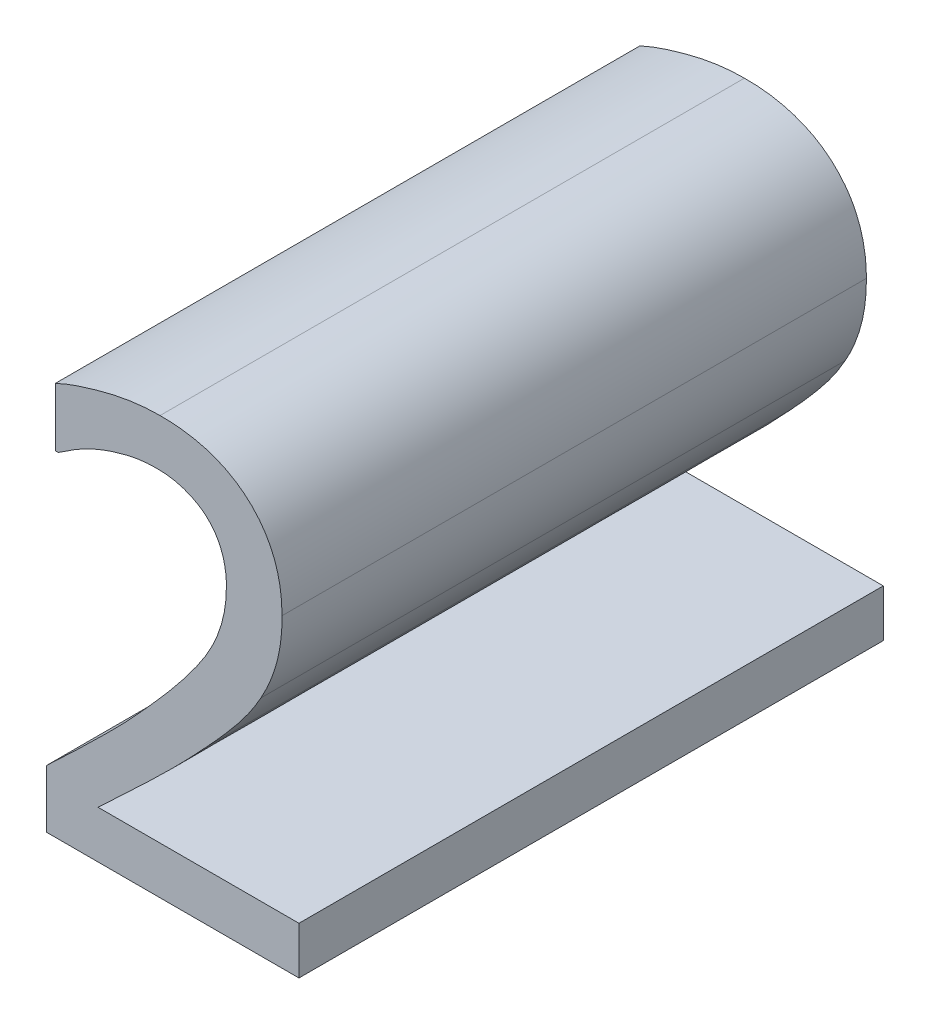
ISO-10303-21;
HEADER;
FILE_DESCRIPTION(('STEP AP214'),'2;1');
FILE_NAME('part.step','',(''),(''),'','','');
FILE_SCHEMA(('AUTOMOTIVE_DESIGN { 1 0 10303 214 1 1 1 1 }'));
ENDSEC;
DATA;
#1=APPLICATION_CONTEXT('core data for automotive mechanical design processes');
#2=APPLICATION_PROTOCOL_DEFINITION('international standard','automotive_design',2000,#1);
#3=PRODUCT_CONTEXT('',#1,'mechanical');
#4=PRODUCT('Part','Part','',(#3));
#5=PRODUCT_RELATED_PRODUCT_CATEGORY('part','',(#4));
#6=PRODUCT_DEFINITION_FORMATION('','',#4);
#7=PRODUCT_DEFINITION_CONTEXT('part definition',#1,'design');
#8=PRODUCT_DEFINITION('design','',#6,#7);
#9=PRODUCT_DEFINITION_SHAPE('','',#8);
#10=(LENGTH_UNIT() NAMED_UNIT(*) SI_UNIT(.MILLI.,.METRE.));
#11=(NAMED_UNIT(*) PLANE_ANGLE_UNIT() SI_UNIT($,.RADIAN.));
#12=(NAMED_UNIT(*) SI_UNIT($,.STERADIAN.) SOLID_ANGLE_UNIT());
#13=UNCERTAINTY_MEASURE_WITH_UNIT(LENGTH_MEASURE(1.E-05),#10,'distance_accuracy_value','');
#14=(GEOMETRIC_REPRESENTATION_CONTEXT(3) GLOBAL_UNCERTAINTY_ASSIGNED_CONTEXT((#13)) GLOBAL_UNIT_ASSIGNED_CONTEXT((#10,
#11,#12)) REPRESENTATION_CONTEXT('',''));
#15=CARTESIAN_POINT('',(0.,0.,0.));
#16=DIRECTION('',(0.,0.,1.));
#17=DIRECTION('',(1.,0.,0.));
#18=AXIS2_PLACEMENT_3D('',#15,#16,#17);
#19=CARTESIAN_POINT('',(0.573294689810317,-0.561987530902696,0.));
#20=DIRECTION('',(-1.,0.,0.));
#21=DIRECTION('',(0.,-1.,0.));
#22=AXIS2_PLACEMENT_3D('',#19,#20,#21);
#23=PLANE('',#22);
#24=DIRECTION('',(0.,1.,0.));
#25=VECTOR('',#24,1.);
#26=CARTESIAN_POINT('',(0.573294689810317,-0.571914597659679,0.));
#27=LINE('',#26,#25);
#28=CARTESIAN_POINT('',(0.573294689810317,-0.571914597659679,0.));
#29=VERTEX_POINT('',#28);
#30=CARTESIAN_POINT('',(0.573294689810317,-0.561987530902696,0.));
#31=VERTEX_POINT('',#30);
#32=EDGE_CURVE('E11',#29,#31,#27,.T.);
#33=ORIENTED_EDGE('',*,*,#32,.F.);
#34=DIRECTION('',(0.,0.,1.));
#35=VECTOR('',#34,1.);
#36=CARTESIAN_POINT('',(0.573294689810317,-0.571914597659679,0.));
#37=LINE('',#36,#35);
#38=CARTESIAN_POINT('',(0.573294689810317,-0.571914597659679,0.1));
#39=VERTEX_POINT('',#38);
#40=EDGE_CURVE('E351',#29,#39,#37,.T.);
#41=ORIENTED_EDGE('',*,*,#40,.T.);
#42=DIRECTION('',(0.,-1.,0.));
#43=VECTOR('',#42,1.);
#44=CARTESIAN_POINT('',(0.573294689810317,-0.561987530902696,0.1));
#45=LINE('',#44,#43);
#46=CARTESIAN_POINT('',(0.573294689810317,-0.561987530902696,0.1));
#47=VERTEX_POINT('',#46);
#48=EDGE_CURVE('E157',#47,#39,#45,.T.);
#49=ORIENTED_EDGE('',*,*,#48,.F.);
#50=DIRECTION('',(0.,0.,1.));
#51=VECTOR('',#50,1.);
#52=CARTESIAN_POINT('',(0.573294689810317,-0.561987530902696,0.));
#53=LINE('',#52,#51);
#54=EDGE_CURVE('E352',#31,#47,#53,.T.);
#55=ORIENTED_EDGE('',*,*,#54,.F.);
#56=EDGE_LOOP('',(#33,#41,#49,#55));
#57=FACE_BOUND('',#56,.T.);
#58=ADVANCED_FACE('F17',(#57),#23,.T.);
#59=CARTESIAN_POINT('',(0.590199066345065,-0.545139880463702,0.));
#60=CARTESIAN_POINT('',(0.590199066345065,-0.545139880463702,0.1));
#61=CARTESIAN_POINT('',(0.586228239642271,-0.549507789836774,0.));
#62=CARTESIAN_POINT('',(0.586228239642271,-0.549507789836774,0.1));
#63=CARTESIAN_POINT('',(0.57794622966216,-0.557619621529623,0.));
#64=CARTESIAN_POINT('',(0.57794622966216,-0.557619621529623,0.1));
#65=CARTESIAN_POINT('',(0.573294689810317,-0.561987530902696,0.));
#66=CARTESIAN_POINT('',(0.573294689810317,-0.561987530902696,0.1));
#67=B_SPLINE_SURFACE_WITH_KNOTS('',2,1,((#59,#60),(#61,#62),(#63,#64),(#65,#66)),.UNSPECIFIED.,
.F.,.F.,.F.,(3,1,3),(2,2),(0.,0.5,1.),(0.,1.),.UNSPECIFIED.);
#68=CARTESIAN_POINT('',(0.573294689810317,-0.561987530902696,0.));
#69=CARTESIAN_POINT('',(0.576216316409611,-0.55917190654432,0.));
#70=CARTESIAN_POINT('',(0.579188711820806,-0.556405094633854,0.));
#71=CARTESIAN_POINT('',(0.582501690728564,-0.553157419107484,0.));
#72=CARTESIAN_POINT('',(0.582914636400098,-0.552749607769018,0.));
#73=CARTESIAN_POINT('',(0.583765351493808,-0.55190173627245,0.));
#74=CARTESIAN_POINT('',(0.584202851229282,-0.551461404882065,0.));
#75=CARTESIAN_POINT('',(0.585512934330286,-0.550130571110377,0.));
#76=CARTESIAN_POINT('',(0.586379305432535,-0.5492339448571,0.));
#77=CARTESIAN_POINT('',(0.588235891459257,-0.547276807118519,0.));
#78=CARTESIAN_POINT('',(0.589223159247303,-0.546213498075349,0.));
#79=CARTESIAN_POINT('',(0.590199066381953,-0.545139880423125,0.));
#80=B_SPLINE_CURVE_WITH_KNOTS('',3,(#68,#69,#70,#71,#72,#73,#74,#75,#76,#77,#78,#79),
.UNSPECIFIED.,.F.,.F.,(4,2,2,2,2,4),(0.,0.0121766036694044,0.0139177205584069,
0.0157798614534184,0.0195200765979185,0.0238726498142932),.UNSPECIFIED.);
#81=CARTESIAN_POINT('',(0.590199066345065,-0.545139880463702,0.));
#82=VERTEX_POINT('',#81);
#83=EDGE_CURVE('E24',#31,#82,#80,.T.);
#84=CARTESIAN_POINT('',(0.590199066345065,-0.545139880463702,0.1));
#85=CARTESIAN_POINT('',(0.587611265979113,-0.548062208761191,0.1));
#86=CARTESIAN_POINT('',(0.584871099533745,-0.55083501950291,0.1));
#87=CARTESIAN_POINT('',(0.581670163810386,-0.553972509806504,0.1));
#88=CARTESIAN_POINT('',(0.581252112153177,-0.554380323541159,0.1));
#89=CARTESIAN_POINT('',(0.580379951566386,-0.555228549779289,0.1));
#90=CARTESIAN_POINT('',(0.579925735994419,-0.555668852074841,0.1));
#91=CARTESIAN_POINT('',(0.578539265538952,-0.557008142088938,0.1));
#92=CARTESIAN_POINT('',(0.577604548128001,-0.557904583348683,0.1));
#93=CARTESIAN_POINT('',(0.575546791079816,-0.559865325585856,0.1));
#94=CARTESIAN_POINT('',(0.574422515104232,-0.560928329933098,0.1));
#95=CARTESIAN_POINT('',(0.573294689810317,-0.561987530902696,0.1));
#96=B_SPLINE_CURVE_WITH_KNOTS('',3,(#84,#85,#86,#87,#88,#89,#90,#91,#92,#93,#94,#95),
.UNSPECIFIED.,.F.,.F.,(4,2,2,2,2,4),(0.,0.0116945562075137,0.0134466018522052,0.015344389911391,
0.0192296811545655,0.0238713644395515),.UNSPECIFIED.);
#97=CARTESIAN_POINT('',(0.590199066345065,-0.545139880463702,0.1));
#98=VERTEX_POINT('',#97);
#99=EDGE_CURVE('E361',#98,#47,#96,.T.);
#100=DIRECTION('',(0.,0.,1.));
#101=VECTOR('',#100,1.);
#102=CARTESIAN_POINT('',(0.590199066345065,-0.545139880463702,0.));
#103=LINE('',#102,#101);
#104=EDGE_CURVE('E365',#82,#98,#103,.T.);
#105=ORIENTED_EDGE('',*,*,#83,.F.);
#106=ORIENTED_EDGE('',*,*,#54,.T.);
#107=ORIENTED_EDGE('',*,*,#99,.F.);
#108=ORIENTED_EDGE('',*,*,#104,.F.);
#109=EDGE_LOOP('',(#105,#106,#107,#108));
#110=FACE_BOUND('',#109,.T.);
#111=ADVANCED_FACE('F266',(#110),#67,.T.);
#112=CARTESIAN_POINT('',(0.604040233709087,-0.520180398331859,0.));
#113=CARTESIAN_POINT('',(0.604040233709087,-0.520180398331859,0.1));
#114=CARTESIAN_POINT('',(0.604040233709087,-0.525796281811523,0.));
#115=CARTESIAN_POINT('',(0.604040233709087,-0.525796281811523,0.1));
#116=CARTESIAN_POINT('',(0.598197445846405,-0.536347335621803,0.));
#117=CARTESIAN_POINT('',(0.598197445846405,-0.536347335621803,0.1));
#118=CARTESIAN_POINT('',(0.590199066345065,-0.545139880463702,0.));
#119=CARTESIAN_POINT('',(0.590199066345065,-0.545139880463702,0.1));
#120=B_SPLINE_SURFACE_WITH_KNOTS('',2,1,((#112,#113),(#114,#115),(#116,#117),(#118,#119)),
.UNSPECIFIED.,.F.,.F.,.F.,(3,1,3),(2,2),(0.,0.5,1.),(0.,1.),.UNSPECIFIED.);
#121=CARTESIAN_POINT('',(0.590199066345065,-0.545139880463702,0.));
#122=CARTESIAN_POINT('',(0.591524711524654,-0.543676533635372,0.));
#123=CARTESIAN_POINT('',(0.592834662049742,-0.542200049203178,0.));
#124=CARTESIAN_POINT('',(0.595396665441898,-0.539173245774514,0.));
#125=CARTESIAN_POINT('',(0.596648024070647,-0.537622344445949,0.));
#126=CARTESIAN_POINT('',(0.599042447356157,-0.534421648737831,0.));
#127=CARTESIAN_POINT('',(0.600185167063988,-0.532771564840157,0.));
#128=CARTESIAN_POINT('',(0.601348278660586,-0.530654459686078,0.));
#129=CARTESIAN_POINT('',(0.601541016040058,-0.530284973397724,0.));
#130=CARTESIAN_POINT('',(0.601929997148157,-0.529491190910432,0.));
#131=CARTESIAN_POINT('',(0.602123802380378,-0.529065705361785,0.));
#132=CARTESIAN_POINT('',(0.602658496609068,-0.527793352123861,0.));
#133=CARTESIAN_POINT('',(0.602963669837758,-0.526931110910572,0.));
#134=CARTESIAN_POINT('',(0.603760028985515,-0.524151288703875,0.));
#135=CARTESIAN_POINT('',(0.60405290659742,-0.522175990312242,0.));
#136=CARTESIAN_POINT('',(0.604040233709087,-0.520180398314576,0.));
#137=B_SPLINE_CURVE_WITH_KNOTS('',3,(#121,#122,#123,#124,#125,#126,#127,#128,#129,#130,#131,
#132,#133,#134,#135,#136),.UNSPECIFIED.,.F.,.F.,(4,2,2,2,2,2,2,4),(0.,0.00592083735917927,
0.0118997721387449,0.0178970979462102,0.019146712576849,0.0205487103418681,0.023285997637654,
0.0292165184775067),.UNSPECIFIED.);
#138=CARTESIAN_POINT('',(0.604040233709087,-0.520180398331859,0.));
#139=VERTEX_POINT('',#138);
#140=EDGE_CURVE('E343',#82,#139,#137,.T.);
#141=CARTESIAN_POINT('',(0.604040233709087,-0.520180398331859,0.1));
#142=CARTESIAN_POINT('',(0.60406417221119,-0.522377012250735,0.1));
#143=CARTESIAN_POINT('',(0.603704080075652,-0.524540135297893,0.1));
#144=CARTESIAN_POINT('',(0.60254558091967,-0.528196073751297,0.1));
#145=CARTESIAN_POINT('',(0.601869775352023,-0.529727117086477,0.1));
#146=CARTESIAN_POINT('',(0.600765014282166,-0.531705845977494,0.1));
#147=CARTESIAN_POINT('',(0.600452349540385,-0.532223349459875,0.1));
#148=CARTESIAN_POINT('',(0.599708882732165,-0.533393617150779,0.1));
#149=CARTESIAN_POINT('',(0.599270341848248,-0.534041499295992,0.1));
#150=CARTESIAN_POINT('',(0.597746587168353,-0.536202450852496,0.1));
#151=CARTESIAN_POINT('',(0.596604757020398,-0.537674612300696,0.1));
#152=CARTESIAN_POINT('',(0.593735519304813,-0.541170982478962,0.1));
#153=CARTESIAN_POINT('',(0.591966488629269,-0.543162082060902,0.1));
#154=CARTESIAN_POINT('',(0.590199066345065,-0.545139880463702,0.1));
#155=B_SPLINE_CURVE_WITH_KNOTS('',3,(#141,#142,#143,#144,#145,#146,#147,#148,#149,#150,#151,
#152,#153,#154),.UNSPECIFIED.,.F.,.F.,(4,2,2,2,2,2,4),(0.,0.00650665118596637,
0.0114873313360519,0.0133008943452759,0.0156467614728971,0.0212325655414484,0.0292067960252894),.UNSPECIFIED.);
#156=CARTESIAN_POINT('',(0.604040233709087,-0.520180398331859,0.1));
#157=VERTEX_POINT('',#156);
#158=EDGE_CURVE('E364',#157,#98,#155,.T.);
#159=DIRECTION('',(0.,0.,1.));
#160=VECTOR('',#159,1.);
#161=CARTESIAN_POINT('',(0.604040233709087,-0.520180398331859,0.));
#162=LINE('',#161,#160);
#163=EDGE_CURVE('E367',#139,#157,#162,.T.);
#164=ORIENTED_EDGE('',*,*,#140,.F.);
#165=ORIENTED_EDGE('',*,*,#104,.T.);
#166=ORIENTED_EDGE('',*,*,#158,.F.);
#167=ORIENTED_EDGE('',*,*,#163,.F.);
#168=EDGE_LOOP('',(#164,#165,#166,#167));
#169=FACE_BOUND('',#168,.T.);
#170=ADVANCED_FACE('F261',(#169),#120,.T.);
#171=CARTESIAN_POINT('',(0.600579941868081,-0.51138785348996,0.));
#172=CARTESIAN_POINT('',(0.600579941868081,-0.51138785348996,0.1));
#173=CARTESIAN_POINT('',(0.602224998644952,-0.512806005883814,0.));
#174=CARTESIAN_POINT('',(0.602224998644952,-0.512806005883814,0.1));
#175=CARTESIAN_POINT('',(0.604040233709087,-0.517230641352641,0.));
#176=CARTESIAN_POINT('',(0.604040233709087,-0.517230641352641,0.1));
#177=CARTESIAN_POINT('',(0.604040233709087,-0.520180398331859,0.));
#178=CARTESIAN_POINT('',(0.604040233709087,-0.520180398331859,0.1));
#179=B_SPLINE_SURFACE_WITH_KNOTS('',2,1,((#171,#172),(#173,#174),(#175,#176),(#177,#178)),
.UNSPECIFIED.,.F.,.F.,.F.,(3,1,3),(2,2),(0.,0.5,1.),(0.,1.),.UNSPECIFIED.);
#180=CARTESIAN_POINT('',(0.604040233709087,-0.520180398331859,0.));
#181=CARTESIAN_POINT('',(0.604070231585503,-0.518822255746776,0.));
#182=CARTESIAN_POINT('',(0.603901593620076,-0.517419398683535,0.));
#183=CARTESIAN_POINT('',(0.603215857143765,-0.51511209191554,0.));
#184=CARTESIAN_POINT('',(0.602802293596008,-0.514173719082866,0.));
#185=CARTESIAN_POINT('',(0.601793792592667,-0.512606249680711,0.));
#186=CARTESIAN_POINT('',(0.601237649941505,-0.511951720961794,0.));
#187=CARTESIAN_POINT('',(0.600579938293071,-0.511387850408054,0.));
#188=B_SPLINE_CURVE_WITH_KNOTS('',3,(#180,#181,#182,#183,#184,#185,#186,#187),.UNSPECIFIED.,.F.,
.F.,(4,2,2,4),(0.,0.00412437798620111,0.00716191922484213,0.00972134548947158),.UNSPECIFIED.);
#189=CARTESIAN_POINT('',(0.600579941868081,-0.51138785348996,0.));
#190=VERTEX_POINT('',#189);
#191=EDGE_CURVE('E335',#139,#190,#188,.T.);
#192=CARTESIAN_POINT('',(0.600579941868081,-0.51138785348996,0.1));
#193=CARTESIAN_POINT('',(0.601266999594053,-0.511977197403441,0.1));
#194=CARTESIAN_POINT('',(0.601842906573219,-0.512664628218597,0.1));
#195=CARTESIAN_POINT('',(0.602839398169584,-0.514253729361758,0.1));
#196=CARTESIAN_POINT('',(0.60323627490595,-0.515170569578766,0.1));
#197=CARTESIAN_POINT('',(0.603903877512074,-0.517443144165378,0.1));
#198=CARTESIAN_POINT('',(0.604069072453246,-0.518833094703272,0.1));
#199=CARTESIAN_POINT('',(0.604040233709087,-0.520180398331859,0.1));
#200=B_SPLINE_CURVE_WITH_KNOTS('',3,(#192,#193,#194,#195,#196,#197,#198,#199),.UNSPECIFIED.,.F.,
.F.,(4,2,2,4),(0.,0.00267100911726211,0.00563254353652575,0.00972143011809526),.UNSPECIFIED.);
#201=CARTESIAN_POINT('',(0.600579941868081,-0.51138785348996,0.1));
#202=VERTEX_POINT('',#201);
#203=EDGE_CURVE('E382',#202,#157,#200,.T.);
#204=DIRECTION('',(0.,0.,1.));
#205=VECTOR('',#204,1.);
#206=CARTESIAN_POINT('',(0.600579941868081,-0.51138785348996,0.));
#207=LINE('',#206,#205);
#208=EDGE_CURVE('E380',#190,#202,#207,.T.);
#209=ORIENTED_EDGE('',*,*,#191,.F.);
#210=ORIENTED_EDGE('',*,*,#163,.T.);
#211=ORIENTED_EDGE('',*,*,#203,.F.);
#212=ORIENTED_EDGE('',*,*,#208,.F.);
#213=EDGE_LOOP('',(#209,#210,#211,#212));
#214=FACE_BOUND('',#213,.T.);
#215=ADVANCED_FACE('F390',(#214),#179,.T.);
#216=CARTESIAN_POINT('',(0.592014301409199,-0.50855154870225,0.));
#217=CARTESIAN_POINT('',(0.592014301409199,-0.50855154870225,0.1));
#218=CARTESIAN_POINT('',(0.594623701813891,-0.50855154870225,0.));
#219=CARTESIAN_POINT('',(0.594623701813891,-0.50855154870225,0.1));
#220=CARTESIAN_POINT('',(0.59893488509121,-0.509969701096105,0.));
#221=CARTESIAN_POINT('',(0.59893488509121,-0.509969701096105,0.1));
#222=CARTESIAN_POINT('',(0.600579941868081,-0.51138785348996,0.));
#223=CARTESIAN_POINT('',(0.600579941868081,-0.51138785348996,0.1));
#224=B_SPLINE_SURFACE_WITH_KNOTS('',2,1,((#216,#217),(#218,#219),(#220,#221),(#222,#223)),
.UNSPECIFIED.,.F.,.F.,.F.,(3,1,3),(2,2),(0.,0.5,1.),(0.,1.),.UNSPECIFIED.);
#225=CARTESIAN_POINT('',(0.600579941868081,-0.51138785348996,0.));
#226=CARTESIAN_POINT('',(0.599745664865478,-0.510654199528889,0.));
#227=CARTESIAN_POINT('',(0.598805019365823,-0.510081761562588,0.));
#228=CARTESIAN_POINT('',(0.59666949610508,-0.509161177782728,0.));
#229=CARTESIAN_POINT('',(0.595457477054397,-0.508851447241249,0.));
#230=CARTESIAN_POINT('',(0.593492142240787,-0.508592586748,0.));
#231=CARTESIAN_POINT('',(0.592749371104029,-0.508548750750198,0.));
#232=CARTESIAN_POINT('',(0.592014300690917,-0.50855154870225,0.));
#233=B_SPLINE_CURVE_WITH_KNOTS('',3,(#225,#226,#227,#228,#229,#230,#231,#232),.UNSPECIFIED.,.F.,
.F.,(4,2,2,4),(0.,0.00327718880556356,0.00697674411635673,0.00919573260062196),.UNSPECIFIED.);
#234=CARTESIAN_POINT('',(0.592014301409199,-0.50855154870225,0.));
#235=VERTEX_POINT('',#234);
#236=EDGE_CURVE('E327',#190,#235,#233,.T.);
#237=CARTESIAN_POINT('',(0.592014301409199,-0.50855154870225,0.1));
#238=CARTESIAN_POINT('',(0.593513450667551,-0.508522783684461,0.1));
#239=CARTESIAN_POINT('',(0.595058884503773,-0.508723611476949,0.1));
#240=CARTESIAN_POINT('',(0.597635103297595,-0.509525500051341,0.1));
#241=CARTESIAN_POINT('',(0.598701506595856,-0.510021467827318,0.1));
#242=CARTESIAN_POINT('',(0.599978587519254,-0.510895682706203,0.1));
#243=CARTESIAN_POINT('',(0.600286502698488,-0.511132663421018,0.1));
#244=CARTESIAN_POINT('',(0.600579941870766,-0.511387853492275,0.1));
#245=B_SPLINE_CURVE_WITH_KNOTS('',3,(#237,#238,#239,#240,#241,#242,#243,#244),.UNSPECIFIED.,.F.,
.F.,(4,2,2,4),(0.,0.00454745343299449,0.00802673764956294,0.00919087766314987),.UNSPECIFIED.);
#246=CARTESIAN_POINT('',(0.592014301409199,-0.50855154870225,0.1));
#247=VERTEX_POINT('',#246);
#248=EDGE_CURVE('E419',#247,#202,#245,.T.);
#249=DIRECTION('',(0.,0.,1.));
#250=VECTOR('',#249,1.);
#251=CARTESIAN_POINT('',(0.592014301409199,-0.50855154870225,0.));
#252=LINE('',#251,#250);
#253=EDGE_CURVE('E424',#235,#247,#252,.T.);
#254=ORIENTED_EDGE('',*,*,#236,.F.);
#255=ORIENTED_EDGE('',*,*,#208,.T.);
#256=ORIENTED_EDGE('',*,*,#248,.F.);
#257=ORIENTED_EDGE('',*,*,#253,.F.);
#258=EDGE_LOOP('',(#254,#255,#256,#257));
#259=FACE_BOUND('',#258,.T.);
#260=ADVANCED_FACE('F395',(#259),#224,.T.);
#261=CARTESIAN_POINT('',(0.582087234652216,-0.510763866436664,0.));
#262=CARTESIAN_POINT('',(0.582087234652216,-0.510763866436664,0.1));
#263=CARTESIAN_POINT('',(0.584413004578137,-0.509799522808842,0.));
#264=CARTESIAN_POINT('',(0.584413004578137,-0.509799522808842,0.1));
#265=CARTESIAN_POINT('',(0.589518353196014,-0.50855154870225,0.));
#266=CARTESIAN_POINT('',(0.589518353196014,-0.50855154870225,0.1));
#267=CARTESIAN_POINT('',(0.592014301409199,-0.50855154870225,0.));
#268=CARTESIAN_POINT('',(0.592014301409199,-0.50855154870225,0.1));
#269=B_SPLINE_SURFACE_WITH_KNOTS('',2,1,((#261,#262),(#263,#264),(#265,#266),(#267,#268)),
.UNSPECIFIED.,.F.,.F.,.F.,(3,1,3),(2,2),(0.,0.5,1.),(0.,1.),.UNSPECIFIED.);
#270=CARTESIAN_POINT('',(0.592014301409199,-0.50855154870225,0.));
#271=CARTESIAN_POINT('',(0.591158552900085,-0.508545347555565,0.));
#272=CARTESIAN_POINT('',(0.590305956338073,-0.508603696123068,0.));
#273=CARTESIAN_POINT('',(0.588621101074845,-0.508821493658442,0.));
#274=CARTESIAN_POINT('',(0.587788728125176,-0.508980022459483,0.));
#275=CARTESIAN_POINT('',(0.586136526910326,-0.509372498741971,0.));
#276=CARTESIAN_POINT('',(0.585316837424512,-0.509606996721446,0.));
#277=CARTESIAN_POINT('',(0.583690099434236,-0.510140324237424,0.));
#278=CARTESIAN_POINT('',(0.582883237582172,-0.510439727888596,0.));
#279=CARTESIAN_POINT('',(0.582087234652216,-0.510763866436664,0.));
#280=B_SPLINE_CURVE_WITH_KNOTS('',3,(#270,#271,#272,#273,#274,#275,#276,#277,#278,#279),
.UNSPECIFIED.,.F.,.F.,(4,2,2,2,4),(0.,0.00255970627533974,0.00509623645174986,
0.00765157447103018,0.0102305115459305),.UNSPECIFIED.);
#281=CARTESIAN_POINT('',(0.582087234652216,-0.510763866436664,0.));
#282=VERTEX_POINT('',#281);
#283=EDGE_CURVE('E317',#235,#282,#280,.T.);
#284=CARTESIAN_POINT('',(0.582087234652216,-0.510763866436664,0.1));
#285=CARTESIAN_POINT('',(0.582883237582168,-0.510439727888595,0.1));
#286=CARTESIAN_POINT('',(0.583690099434229,-0.510140324237425,0.1));
#287=CARTESIAN_POINT('',(0.585316837424507,-0.509606996721449,0.1));
#288=CARTESIAN_POINT('',(0.586136526910324,-0.509372498741975,0.1));
#289=CARTESIAN_POINT('',(0.587788728124342,-0.508980022459678,0.1));
#290=CARTESIAN_POINT('',(0.588621101073155,-0.508821493658753,0.1));
#291=CARTESIAN_POINT('',(0.590305956334638,-0.508603696123401,0.1));
#292=CARTESIAN_POINT('',(0.591158552895759,-0.5085453475558,0.1));
#293=CARTESIAN_POINT('',(0.592014301403989,-0.50855154870225,0.1));
#294=B_SPLINE_CURVE_WITH_KNOTS('',3,(#284,#285,#286,#287,#288,#289,#290,#291,#292,#293),
.UNSPECIFIED.,.F.,.F.,(4,2,2,2,4),(0.,0.00257893707489087,0.00513427509418064,
0.00767080526802346,0.0102305115407303),.UNSPECIFIED.);
#295=CARTESIAN_POINT('',(0.582087234652216,-0.510763866436664,0.1));
#296=VERTEX_POINT('',#295);
#297=EDGE_CURVE('E422',#296,#247,#294,.T.);
#298=DIRECTION('',(0.,0.,1.));
#299=VECTOR('',#298,1.);
#300=CARTESIAN_POINT('',(0.582087234652216,-0.510763866436664,0.));
#301=LINE('',#300,#299);
#302=EDGE_CURVE('E428',#282,#296,#301,.T.);
#303=ORIENTED_EDGE('',*,*,#283,.F.);
#304=ORIENTED_EDGE('',*,*,#253,.T.);
#305=ORIENTED_EDGE('',*,*,#297,.F.);
#306=ORIENTED_EDGE('',*,*,#302,.F.);
#307=EDGE_LOOP('',(#303,#304,#305,#306));
#308=FACE_BOUND('',#307,.T.);
#309=ADVANCED_FACE('F439',(#308),#269,.T.);
#310=CARTESIAN_POINT('',(0.575280103161713,-0.514621240947948,0.));
#311=CARTESIAN_POINT('',(0.575280103161713,-0.514621240947948,0.1));
#312=CARTESIAN_POINT('',(0.576414625076797,-0.51382707560739,0.));
#313=CARTESIAN_POINT('',(0.576414625076797,-0.51382707560739,0.1));
#314=CARTESIAN_POINT('',(0.580101821300819,-0.511558031777222,0.));
#315=CARTESIAN_POINT('',(0.580101821300819,-0.511558031777222,0.1));
#316=CARTESIAN_POINT('',(0.582087234652216,-0.510763866436664,0.));
#317=CARTESIAN_POINT('',(0.582087234652216,-0.510763866436664,0.1));
#318=B_SPLINE_SURFACE_WITH_KNOTS('',2,1,((#310,#311),(#312,#313),(#314,#315),(#316,#317)),
.UNSPECIFIED.,.F.,.F.,.F.,(3,1,3),(2,2),(0.,0.5,1.),(0.,1.),.UNSPECIFIED.);
#319=CARTESIAN_POINT('',(0.582087234652216,-0.510763866436664,0.));
#320=CARTESIAN_POINT('',(0.580732992394999,-0.51126516772344,0.));
#321=CARTESIAN_POINT('',(0.579478720933333,-0.511949656539129,0.));
#322=CARTESIAN_POINT('',(0.577897546980419,-0.512912091442426,0.));
#323=CARTESIAN_POINT('',(0.577539820250363,-0.513136729939855,0.));
#324=CARTESIAN_POINT('',(0.576859655881338,-0.513568921794931,0.));
#325=CARTESIAN_POINT('',(0.576537000324371,-0.513776144946892,0.));
#326=CARTESIAN_POINT('',(0.575901788077059,-0.514194264618407,0.));
#327=CARTESIAN_POINT('',(0.575589152712453,-0.514405042135403,0.));
#328=CARTESIAN_POINT('',(0.57528010316312,-0.514621240946963,0.));
#329=B_SPLINE_CURVE_WITH_KNOTS('',3,(#319,#320,#321,#322,#323,#324,#325,#326,#327,#328),
.UNSPECIFIED.,.F.,.F.,(4,2,2,2,4),(0.,0.00428732594090233,0.00555429775329131,
0.00670467168244862,0.00783584904493355),.UNSPECIFIED.);
#330=CARTESIAN_POINT('',(0.575280103161713,-0.514621240947948,0.));
#331=VERTEX_POINT('',#330);
#332=EDGE_CURVE('E307',#282,#331,#329,.T.);
#333=CARTESIAN_POINT('',(0.575280103161713,-0.514621240947948,0.1));
#334=CARTESIAN_POINT('',(0.575752210850818,-0.514298398797895,0.1));
#335=CARTESIAN_POINT('',(0.576227396459358,-0.513979887178841,0.1));
#336=CARTESIAN_POINT('',(0.577230755029632,-0.513326593784717,0.1));
#337=CARTESIAN_POINT('',(0.57775973943285,-0.512993061577079,0.1));
#338=CARTESIAN_POINT('',(0.578664360267754,-0.512447007068512,0.1));
#339=CARTESIAN_POINT('',(0.579036648798705,-0.512229048891497,0.1));
#340=CARTESIAN_POINT('',(0.579816123471838,-0.511802064786014,0.1));
#341=CARTESIAN_POINT('',(0.580224054875496,-0.511594388663626,0.1));
#342=CARTESIAN_POINT('',(0.581114082661705,-0.511171871837105,0.1));
#343=CARTESIAN_POINT('',(0.581597976689262,-0.510960796810176,0.1));
#344=CARTESIAN_POINT('',(0.582087234652216,-0.510763866436664,0.1));
#345=B_SPLINE_CURVE_WITH_KNOTS('',3,(#333,#334,#335,#336,#337,#338,#339,#340,#341,#342,#343,
#344),.UNSPECIFIED.,.F.,.F.,(4,2,2,2,2,4),(0.,0.00171592048433093,0.00359173599418033,
0.00488550807886556,0.00625797846467483,0.00784044577355749),.UNSPECIFIED.);
#346=CARTESIAN_POINT('',(0.575280103161713,-0.514621240947948,0.1));
#347=VERTEX_POINT('',#346);
#348=EDGE_CURVE('E474',#347,#296,#345,.T.);
#349=DIRECTION('',(0.,0.,1.));
#350=VECTOR('',#349,1.);
#351=CARTESIAN_POINT('',(0.575280103161713,-0.514621240947948,0.));
#352=LINE('',#351,#350);
#353=EDGE_CURVE('E479',#331,#347,#352,.T.);
#354=ORIENTED_EDGE('',*,*,#332,.F.);
#355=ORIENTED_EDGE('',*,*,#302,.T.);
#356=ORIENTED_EDGE('',*,*,#348,.F.);
#357=ORIENTED_EDGE('',*,*,#353,.F.);
#358=EDGE_LOOP('',(#354,#355,#356,#357));
#359=FACE_BOUND('',#358,.T.);
#360=ADVANCED_FACE('F450',(#359),#318,.T.);
#361=CARTESIAN_POINT('',(0.574769568299925,-0.514621240947948,0.));
#362=DIRECTION('',(0.,-1.,0.));
#363=DIRECTION('',(1.,0.,0.));
#364=AXIS2_PLACEMENT_3D('',#361,#362,#363);
#365=PLANE('',#364);
#366=DIRECTION('',(-1.,0.,0.));
#367=VECTOR('',#366,1.);
#368=CARTESIAN_POINT('',(0.575280103161713,-0.514621240947948,0.));
#369=LINE('',#368,#367);
#370=CARTESIAN_POINT('',(0.574769568299925,-0.514621240947948,0.));
#371=VERTEX_POINT('',#370);
#372=EDGE_CURVE('E425',#331,#371,#369,.T.);
#373=ORIENTED_EDGE('',*,*,#372,.F.);
#374=ORIENTED_EDGE('',*,*,#353,.T.);
#375=DIRECTION('',(1.,0.,0.));
#376=VECTOR('',#375,1.);
#377=CARTESIAN_POINT('',(0.574769568299925,-0.514621240947948,0.1));
#378=LINE('',#377,#376);
#379=CARTESIAN_POINT('',(0.574769568299925,-0.514621240947948,0.1));
#380=VERTEX_POINT('',#379);
#381=EDGE_CURVE('E478',#380,#347,#378,.T.);
#382=ORIENTED_EDGE('',*,*,#381,.F.);
#383=DIRECTION('',(0.,0.,1.));
#384=VECTOR('',#383,1.);
#385=CARTESIAN_POINT('',(0.574769568299925,-0.514621240947948,0.));
#386=LINE('',#385,#384);
#387=EDGE_CURVE('E481',#371,#380,#386,.T.);
#388=ORIENTED_EDGE('',*,*,#387,.F.);
#389=EDGE_LOOP('',(#373,#374,#382,#388));
#390=FACE_BOUND('',#389,.T.);
#391=ADVANCED_FACE('F500',(#390),#365,.T.);
#392=CARTESIAN_POINT('',(0.574769568299925,-0.504637448095211,0.));
#393=DIRECTION('',(-1.,0.,0.));
#394=DIRECTION('',(0.,-1.,0.));
#395=AXIS2_PLACEMENT_3D('',#392,#393,#394);
#396=PLANE('',#395);
#397=DIRECTION('',(0.,1.,0.));
#398=VECTOR('',#397,1.);
#399=CARTESIAN_POINT('',(0.574769568299925,-0.514621240947948,0.));
#400=LINE('',#399,#398);
#401=CARTESIAN_POINT('',(0.574769568299925,-0.504637448095211,0.));
#402=VERTEX_POINT('',#401);
#403=EDGE_CURVE('E468',#371,#402,#400,.T.);
#404=ORIENTED_EDGE('',*,*,#403,.F.);
#405=ORIENTED_EDGE('',*,*,#387,.T.);
#406=DIRECTION('',(0.,-1.,0.));
#407=VECTOR('',#406,1.);
#408=CARTESIAN_POINT('',(0.574769568299925,-0.504637448095211,0.1));
#409=LINE('',#408,#407);
#410=CARTESIAN_POINT('',(0.574769568299925,-0.504637448095211,0.1));
#411=VERTEX_POINT('',#410);
#412=EDGE_CURVE('E252',#411,#380,#409,.T.);
#413=ORIENTED_EDGE('',*,*,#412,.F.);
#414=DIRECTION('',(0.,0.,1.));
#415=VECTOR('',#414,1.);
#416=CARTESIAN_POINT('',(0.574769568299925,-0.504637448095211,0.));
#417=LINE('',#416,#415);
#418=EDGE_CURVE('E491',#402,#411,#417,.T.);
#419=ORIENTED_EDGE('',*,*,#418,.F.);
#420=EDGE_LOOP('',(#404,#405,#413,#419));
#421=FACE_BOUND('',#420,.T.);
#422=ADVANCED_FACE('F498',(#421),#396,.T.);
#423=CARTESIAN_POINT('',(0.592695014558249,-0.500439717009401,0.));
#424=CARTESIAN_POINT('',(0.592695014558249,-0.500439717009401,0.1));
#425=CARTESIAN_POINT('',(0.588043474706406,-0.500439717009401,0.));
#426=CARTESIAN_POINT('',(0.588043474706406,-0.500439717009401,0.1));
#427=CARTESIAN_POINT('',(0.577662599183389,-0.503219295701357,0.));
#428=CARTESIAN_POINT('',(0.577662599183389,-0.503219295701357,0.1));
#429=CARTESIAN_POINT('',(0.574769568299925,-0.504637448095211,0.));
#430=CARTESIAN_POINT('',(0.574769568299925,-0.504637448095211,0.1));
#431=B_SPLINE_SURFACE_WITH_KNOTS('',2,1,((#423,#424),(#425,#426),(#427,#428),(#429,#430)),
.UNSPECIFIED.,.F.,.F.,.F.,(3,1,3),(2,2),(0.,0.5,1.),(0.,1.),.UNSPECIFIED.);
#432=CARTESIAN_POINT('',(0.574769568299925,-0.504637448095211,0.));
#433=CARTESIAN_POINT('',(0.575723895001914,-0.504185517917475,0.));
#434=CARTESIAN_POINT('',(0.576698725124831,-0.503784265499204,0.));
#435=CARTESIAN_POINT('',(0.579311184294512,-0.50282506422585,0.));
#436=CARTESIAN_POINT('',(0.580972857545884,-0.502331704906202,0.));
#437=CARTESIAN_POINT('',(0.583227350031078,-0.501730063709279,0.));
#438=CARTESIAN_POINT('',(0.583811107151062,-0.501580339463478,0.));
#439=CARTESIAN_POINT('',(0.584935981868762,-0.501318735083703,0.));
#440=CARTESIAN_POINT('',(0.58547659089829,-0.501204739146458,0.));
#441=CARTESIAN_POINT('',(0.587065690362383,-0.500902151894957,0.));
#442=CARTESIAN_POINT('',(0.588119941718635,-0.500742504555591,0.));
#443=CARTESIAN_POINT('',(0.590346438551188,-0.500505960659923,0.));
#444=CARTESIAN_POINT('',(0.591519737538325,-0.500439181621366,0.));
#445=CARTESIAN_POINT('',(0.592695014558249,-0.500439717009401,0.));
#446=B_SPLINE_CURVE_WITH_KNOTS('',3,(#432,#433,#434,#435,#436,#437,#438,#439,#440,#441,#442,
#443,#444,#445),.UNSPECIFIED.,.F.,.F.,(4,2,2,2,2,2,4),(0.,0.0031615158714135,
0.00835102058707288,0.010158997140672,0.0118160449842019,0.0150107970263109,0.0185318560347153),.UNSPECIFIED.);
#447=CARTESIAN_POINT('',(0.592695014558249,-0.500439717009401,0.));
#448=VERTEX_POINT('',#447);
#449=EDGE_CURVE('E298',#402,#448,#446,.T.);
#450=CARTESIAN_POINT('',(0.592695014558249,-0.500439717009401,0.1));
#451=CARTESIAN_POINT('',(0.59112185370362,-0.500440300590919,0.1));
#452=CARTESIAN_POINT('',(0.589553500476814,-0.500558958649346,0.1));
#453=CARTESIAN_POINT('',(0.586453335429828,-0.50098887760499,0.1));
#454=CARTESIAN_POINT('',(0.584921348924231,-0.501298839461806,0.1));
#455=CARTESIAN_POINT('',(0.582984699393494,-0.501792359836876,0.1));
#456=CARTESIAN_POINT('',(0.582560750867552,-0.501906777133215,0.1));
#457=CARTESIAN_POINT('',(0.581373829808555,-0.502236213615014,0.1));
#458=CARTESIAN_POINT('',(0.580612733348325,-0.502458057168336,0.1));
#459=CARTESIAN_POINT('',(0.578970883055163,-0.50296958639819,0.1));
#460=CARTESIAN_POINT('',(0.578091634892583,-0.503264401833177,0.1));
#461=CARTESIAN_POINT('',(0.576392874753508,-0.503906298922946,0.1));
#462=CARTESIAN_POINT('',(0.57557237999202,-0.504250819188127,0.1));
#463=CARTESIAN_POINT('',(0.574769568299925,-0.504637448095211,0.1));
#464=B_SPLINE_CURVE_WITH_KNOTS('',3,(#450,#451,#452,#453,#454,#455,#456,#457,#458,#459,#460,
#461,#462,#463),.UNSPECIFIED.,.F.,.F.,(4,2,2,2,2,2,4),(0.,0.00470874644985155,
0.00938586489214671,0.0107032565631256,0.0130813829969706,0.0158612414537463,
0.0185299408991349),.UNSPECIFIED.);
#465=CARTESIAN_POINT('',(0.592695014558249,-0.500439717009401,0.1));
#466=VERTEX_POINT('',#465);
#467=EDGE_CURVE('E497',#466,#411,#464,.T.);
#468=DIRECTION('',(0.,0.,1.));
#469=VECTOR('',#468,1.);
#470=CARTESIAN_POINT('',(0.592695014558249,-0.500439717009401,0.));
#471=LINE('',#470,#469);
#472=EDGE_CURVE('E253',#448,#466,#471,.T.);
#473=ORIENTED_EDGE('',*,*,#449,.F.);
#474=ORIENTED_EDGE('',*,*,#418,.T.);
#475=ORIENTED_EDGE('',*,*,#467,.F.);
#476=ORIENTED_EDGE('',*,*,#472,.F.);
#477=EDGE_LOOP('',(#473,#474,#475,#476));
#478=FACE_BOUND('',#477,.T.);
#479=ADVANCED_FACE('F506',(#478),#431,.T.);
#480=CARTESIAN_POINT('',(0.61357021779579,-0.519669863470071,0.));
#481=CARTESIAN_POINT('',(0.61357021779579,-0.519669863470071,0.1));
#482=CARTESIAN_POINT('',(0.61357021779579,-0.510820592532418,0.));
#483=CARTESIAN_POINT('',(0.61357021779579,-0.510820592532418,0.1));
#484=CARTESIAN_POINT('',(0.602508629123723,-0.500439717009401,0.));
#485=CARTESIAN_POINT('',(0.602508629123723,-0.500439717009401,0.1));
#486=CARTESIAN_POINT('',(0.592695014558249,-0.500439717009401,0.));
#487=CARTESIAN_POINT('',(0.592695014558249,-0.500439717009401,0.1));
#488=B_SPLINE_SURFACE_WITH_KNOTS('',2,1,((#480,#481),(#482,#483),(#484,#485),(#486,#487)),
.UNSPECIFIED.,.F.,.F.,.F.,(3,1,3),(2,2),(0.,0.5,1.),(0.,1.),.UNSPECIFIED.);
#489=CARTESIAN_POINT('',(0.592695014558249,-0.500439717009401,0.));
#490=CARTESIAN_POINT('',(0.595318287264719,-0.500397798399018,0.));
#491=CARTESIAN_POINT('',(0.598045817535943,-0.500710064715241,0.));
#492=CARTESIAN_POINT('',(0.602519867466159,-0.502046464478418,0.));
#493=CARTESIAN_POINT('',(0.604336023532649,-0.502862342056252,0.));
#494=CARTESIAN_POINT('',(0.607412537582716,-0.504949302088161,0.));
#495=CARTESIAN_POINT('',(0.608712427785279,-0.506158888549942,0.));
#496=CARTESIAN_POINT('',(0.610843079733854,-0.508887088800989,0.));
#497=CARTESIAN_POINT('',(0.611684482227135,-0.510397471276909,0.));
#498=CARTESIAN_POINT('',(0.612945641999857,-0.513738767027488,0.));
#499=CARTESIAN_POINT('',(0.613319058260568,-0.515586416039221,0.));
#500=CARTESIAN_POINT('',(0.613541382772436,-0.518186902531669,0.));
#501=CARTESIAN_POINT('',(0.613570637175046,-0.518930421007781,0.));
#502=CARTESIAN_POINT('',(0.61357021779579,-0.519669865484994,0.));
#503=B_SPLINE_CURVE_WITH_KNOTS('',3,(#489,#490,#491,#492,#493,#494,#495,#496,#497,#498,#499,
#500,#501,#502),.UNSPECIFIED.,.F.,.F.,(4,2,2,2,2,2,4),(0.,0.00799345192914853,
0.0138897760095676,0.019123137565657,0.0242292188772302,0.0298088468736183,0.0320354749233682),.UNSPECIFIED.);
#504=CARTESIAN_POINT('',(0.61357021779579,-0.519669863470071,0.));
#505=VERTEX_POINT('',#504);
#506=EDGE_CURVE('E290',#448,#505,#503,.T.);
#507=CARTESIAN_POINT('',(0.61357021779579,-0.519669863470071,0.1));
#508=CARTESIAN_POINT('',(0.613568968735143,-0.518552865609963,0.1));
#509=CARTESIAN_POINT('',(0.613503266297554,-0.517431203471963,0.1));
#510=CARTESIAN_POINT('',(0.613205939788636,-0.515204797186256,0.1));
#511=CARTESIAN_POINT('',(0.612973401510637,-0.51410018066033,0.1));
#512=CARTESIAN_POINT('',(0.612110880618919,-0.511323566517546,0.1));
#513=CARTESIAN_POINT('',(0.611328698049318,-0.509693568393347,0.1));
#514=CARTESIAN_POINT('',(0.609320035705978,-0.506824059542324,0.1));
#515=CARTESIAN_POINT('',(0.608110488665896,-0.505572645080523,0.1));
#516=CARTESIAN_POINT('',(0.605318441762312,-0.503443216951415,0.1));
#517=CARTESIAN_POINT('',(0.603722180121419,-0.502583504159674,0.1));
#518=CARTESIAN_POINT('',(0.600096367679544,-0.50122110480616,0.1));
#519=CARTESIAN_POINT('',(0.598038606868748,-0.50079949212939,0.1));
#520=CARTESIAN_POINT('',(0.594874609604048,-0.500487963774508,0.1));
#521=CARTESIAN_POINT('',(0.593780495473793,-0.500440642706806,0.1));
#522=CARTESIAN_POINT('',(0.592695011825789,-0.500439717009401,0.1));
#523=B_SPLINE_CURVE_WITH_KNOTS('',3,(#507,#508,#509,#510,#511,#512,#513,#514,#515,#516,#517,
#518,#519,#520,#521,#522),.UNSPECIFIED.,.F.,.F.,(4,2,2,2,2,2,2,4),(0.,0.00335570588104571,
0.00672994178384968,0.0120588098669923,0.0171966444164699,0.0225546661887966,0.0287863557245979,
0.0320591477113257),.UNSPECIFIED.);
#524=CARTESIAN_POINT('',(0.61357021779579,-0.519669863470071,0.1));
#525=VERTEX_POINT('',#524);
#526=EDGE_CURVE('E525',#525,#466,#523,.T.);
#527=DIRECTION('',(0.,0.,1.));
#528=VECTOR('',#527,1.);
#529=CARTESIAN_POINT('',(0.61357021779579,-0.519669863470071,0.));
#530=LINE('',#529,#528);
#531=EDGE_CURVE('E523',#505,#525,#530,.T.);
#532=ORIENTED_EDGE('',*,*,#506,.F.);
#533=ORIENTED_EDGE('',*,*,#472,.T.);
#534=ORIENTED_EDGE('',*,*,#526,.F.);
#535=ORIENTED_EDGE('',*,*,#531,.F.);
#536=EDGE_LOOP('',(#532,#533,#534,#535));
#537=FACE_BOUND('',#536,.T.);
#538=ADVANCED_FACE('F230',(#537),#488,.T.);
#539=CARTESIAN_POINT('',(0.609939747667522,-0.533681209121356,0.));
#540=CARTESIAN_POINT('',(0.609939747667522,-0.533681209121356,0.1));
#541=CARTESIAN_POINT('',(0.611641530540148,-0.530731452142138,0.));
#542=CARTESIAN_POINT('',(0.611641530540148,-0.530731452142138,0.1));
#543=CARTESIAN_POINT('',(0.61357021779579,-0.523810868460127,0.));
#544=CARTESIAN_POINT('',(0.61357021779579,-0.523810868460127,0.1));
#545=CARTESIAN_POINT('',(0.61357021779579,-0.519669863470071,0.));
#546=CARTESIAN_POINT('',(0.61357021779579,-0.519669863470071,0.1));
#547=B_SPLINE_SURFACE_WITH_KNOTS('',2,1,((#539,#540),(#541,#542),(#543,#544),(#545,#546)),
.UNSPECIFIED.,.F.,.F.,.F.,(3,1,3),(2,2),(0.,0.5,1.),(0.,1.),.UNSPECIFIED.);
#548=CARTESIAN_POINT('',(0.61357021779579,-0.519669863470071,0.));
#549=CARTESIAN_POINT('',(0.613594723295556,-0.522295725723965,0.));
#550=CARTESIAN_POINT('',(0.613273275419616,-0.524829491334319,0.));
#551=CARTESIAN_POINT('',(0.612001171344973,-0.529483448805852,0.));
#552=CARTESIAN_POINT('',(0.611112462511491,-0.531620131745927,0.));
#553=CARTESIAN_POINT('',(0.609939747667522,-0.533681209121356,0.));
#554=B_SPLINE_CURVE_WITH_KNOTS('',3,(#548,#549,#550,#551,#552,#553),.UNSPECIFIED.,.F.,.F.,(4,2,
4),(0.,0.00766222370767338,0.014604626490142),.UNSPECIFIED.);
#555=CARTESIAN_POINT('',(0.609939747667522,-0.533681209121356,0.));
#556=VERTEX_POINT('',#555);
#557=EDGE_CURVE('E243',#505,#556,#554,.T.);
#558=CARTESIAN_POINT('',(0.609939747667522,-0.533681209121356,0.1));
#559=CARTESIAN_POINT('',(0.611112462506812,-0.53162013173613,0.1));
#560=CARTESIAN_POINT('',(0.612001171340295,-0.529483448796055,0.1));
#561=CARTESIAN_POINT('',(0.613273275720624,-0.524829490262795,0.1));
#562=CARTESIAN_POINT('',(0.613594723596564,-0.522295723511202,0.1));
#563=CARTESIAN_POINT('',(0.61357021779579,-0.519669860046354,0.1));
#564=B_SPLINE_CURVE_WITH_KNOTS('',3,(#558,#559,#560,#561,#562,#563),.UNSPECIFIED.,.F.,.F.,(4,2,
4),(0.,0.00694240278246863,0.0146046298866351),.UNSPECIFIED.);
#565=CARTESIAN_POINT('',(0.609939747667522,-0.533681209121356,0.1));
#566=VERTEX_POINT('',#565);
#567=EDGE_CURVE('E216',#566,#525,#564,.T.);
#568=DIRECTION('',(0.,0.,1.));
#569=VECTOR('',#568,1.);
#570=CARTESIAN_POINT('',(0.609939747667522,-0.533681209121356,0.));
#571=LINE('',#570,#569);
#572=EDGE_CURVE('E223',#556,#566,#571,.T.);
#573=ORIENTED_EDGE('',*,*,#557,.F.);
#574=ORIENTED_EDGE('',*,*,#531,.T.);
#575=ORIENTED_EDGE('',*,*,#567,.F.);
#576=ORIENTED_EDGE('',*,*,#572,.F.);
#577=EDGE_LOOP('',(#573,#574,#575,#576));
#578=FACE_BOUND('',#577,.T.);
#579=ADVANCED_FACE('F224',(#578),#547,.T.);
#580=CARTESIAN_POINT('',(0.600579941868081,-0.545650415325489,0.));
#581=CARTESIAN_POINT('',(0.600579941868081,-0.545650415325489,0.1));
#582=CARTESIAN_POINT('',(0.603302794464282,-0.542757384442026,0.));
#583=CARTESIAN_POINT('',(0.603302794464282,-0.542757384442026,0.1));
#584=CARTESIAN_POINT('',(0.608237964794896,-0.536744418292082,0.));
#585=CARTESIAN_POINT('',(0.608237964794896,-0.536744418292082,0.1));
#586=CARTESIAN_POINT('',(0.609939747667522,-0.533681209121356,0.));
#587=CARTESIAN_POINT('',(0.609939747667522,-0.533681209121356,0.1));
#588=B_SPLINE_SURFACE_WITH_KNOTS('',2,1,((#580,#581),(#582,#583),(#584,#585),(#586,#587)),
.UNSPECIFIED.,.F.,.F.,.F.,(3,1,3),(2,2),(0.,0.5,1.),(0.,1.),.UNSPECIFIED.);
#589=CARTESIAN_POINT('',(0.609939747667522,-0.533681209121356,0.));
#590=CARTESIAN_POINT('',(0.609344252503664,-0.534760562913462,0.));
#591=CARTESIAN_POINT('',(0.608688810299359,-0.535803798661812,0.));
#592=CARTESIAN_POINT('',(0.607289218602792,-0.537823658574003,0.));
#593=CARTESIAN_POINT('',(0.606545414265313,-0.538800519921879,0.));
#594=CARTESIAN_POINT('',(0.605524186950061,-0.540052793623047,0.));
#595=CARTESIAN_POINT('',(0.605274843000474,-0.540352013964977,0.));
#596=CARTESIAN_POINT('',(0.60475635939525,-0.540969434930863,0.));
#597=CARTESIAN_POINT('',(0.60448705489962,-0.541287499398887,0.));
#598=CARTESIAN_POINT('',(0.603671037927208,-0.54224019512947,0.));
#599=CARTESIAN_POINT('',(0.603118838064197,-0.542870129215974,0.));
#600=CARTESIAN_POINT('',(0.601908758678874,-0.544220890052515,0.));
#601=CARTESIAN_POINT('',(0.601248474687349,-0.544939565613967,0.));
#602=CARTESIAN_POINT('',(0.600579941826843,-0.545650415369304,0.));
#603=B_SPLINE_CURVE_WITH_KNOTS('',3,(#589,#590,#591,#592,#593,#594,#595,#596,#597,#598,#599,
#600,#601,#602),.UNSPECIFIED.,.F.,.F.,(4,2,2,2,2,2,4),(0.,0.00369258961464741,
0.00737120247455411,0.00853972781472571,0.00978997826194409,0.0123028745297647,
0.0152303669436673),.UNSPECIFIED.);
#604=CARTESIAN_POINT('',(0.600579941868081,-0.545650415325489,0.));
#605=VERTEX_POINT('',#604);
#606=EDGE_CURVE('E281',#556,#605,#603,.T.);
#607=CARTESIAN_POINT('',(0.600579941868081,-0.545650415325489,0.1));
#608=CARTESIAN_POINT('',(0.601473997516036,-0.54469447798075,0.1));
#609=CARTESIAN_POINT('',(0.602357247488573,-0.543727680577216,0.1));
#610=CARTESIAN_POINT('',(0.604091336824753,-0.541763742353644,0.1));
#611=CARTESIAN_POINT('',(0.604942141266754,-0.540766570807735,0.1));
#612=CARTESIAN_POINT('',(0.606014116256056,-0.539452006925274,0.1));
#613=CARTESIAN_POINT('',(0.606255898606118,-0.539151510511959,0.1));
#614=CARTESIAN_POINT('',(0.606742446749372,-0.53852914451512,0.1));
#615=CARTESIAN_POINT('',(0.606986790555072,-0.538206944399704,0.1));
#616=CARTESIAN_POINT('',(0.607694204332075,-0.5372470666019,0.1));
#617=CARTESIAN_POINT('',(0.608144836052148,-0.536600117798464,0.1));
#618=CARTESIAN_POINT('',(0.609056471303465,-0.535203525115839,0.1));
#619=CARTESIAN_POINT('',(0.609512579157507,-0.534450691678022,0.1));
#620=CARTESIAN_POINT('',(0.609939747667522,-0.533681209121356,0.1));
#621=B_SPLINE_CURVE_WITH_KNOTS('',3,(#607,#608,#609,#610,#611,#612,#613,#614,#615,#616,#617,
#618,#619,#620),.UNSPECIFIED.,.F.,.F.,(4,2,2,2,2,2,4),(0.,0.00392740453819102,
0.00785892330529609,0.00901590321650333,0.0102288807557548,0.0125927418060622,
0.0152316903823549),.UNSPECIFIED.);
#622=CARTESIAN_POINT('',(0.600579941868081,-0.545650415325489,0.1));
#623=VERTEX_POINT('',#622);
#624=EDGE_CURVE('E209',#623,#566,#621,.T.);
#625=CARTESIAN_POINT('',(0.600579940700031,-0.545650416598364,0.));
#626=CARTESIAN_POINT('',(0.600579941284056,-0.545650415961927,0.0166666666666667));
#627=CARTESIAN_POINT('',(0.600579941673406,-0.545650415537635,0.0333333333333333));
#628=CARTESIAN_POINT('',(0.600579942062756,-0.545650415113343,0.0666666666666667));
#629=CARTESIAN_POINT('',(0.600579942062756,-0.545650415113343,0.0833333333333333));
#630=CARTESIAN_POINT('',(0.600579941868081,-0.545650415325489,0.1));
#631=B_SPLINE_CURVE_WITH_KNOTS('',3,(#625,#626,#627,#628,#629,#630),.UNSPECIFIED.,.F.,.F.,(4,2,
4),(0.,0.05,0.1),.UNSPECIFIED.);
#632=EDGE_CURVE('E201',#605,#623,#631,.T.);
#633=ORIENTED_EDGE('',*,*,#606,.F.);
#634=ORIENTED_EDGE('',*,*,#572,.T.);
#635=ORIENTED_EDGE('',*,*,#624,.F.);
#636=ORIENTED_EDGE('',*,*,#632,.F.);
#637=EDGE_LOOP('',(#633,#634,#635,#636));
#638=FACE_BOUND('',#637,.T.);
#639=ADVANCED_FACE('F185',(#638),#588,.T.);
#640=CARTESIAN_POINT('',(0.582087234652216,-0.56380276596683,0.));
#641=CARTESIAN_POINT('',(0.582087234652216,-0.56380276596683,0.1));
#642=CARTESIAN_POINT('',(0.585320622110205,-0.560796282891858,0.));
#643=CARTESIAN_POINT('',(0.585320622110205,-0.560796282891858,0.1));
#644=CARTESIAN_POINT('',(0.596155306399254,-0.550472133464595,0.));
#645=CARTESIAN_POINT('',(0.596155306399254,-0.550472133464595,0.1));
#646=CARTESIAN_POINT('',(0.600579941868081,-0.545650415325489,0.));
#647=CARTESIAN_POINT('',(0.600579941868081,-0.545650415325489,0.1));
#648=B_SPLINE_SURFACE_WITH_KNOTS('',2,1,((#640,#641),(#642,#643),(#644,#645),(#646,#647)),
.UNSPECIFIED.,.F.,.F.,.F.,(3,1,3),(2,2),(0.,0.5,1.),(0.,1.),.UNSPECIFIED.);
#649=CARTESIAN_POINT('',(0.600579940700031,-0.545650416598364,0.));
#650=CARTESIAN_POINT('',(0.599000053317345,-0.547373991857744,0.));
#651=CARTESIAN_POINT('',(0.597384203183312,-0.549063662132359,0.));
#652=CARTESIAN_POINT('',(0.594098044516053,-0.552387201637168,0.));
#653=CARTESIAN_POINT('',(0.592427771740987,-0.554021106118397,0.));
#654=CARTESIAN_POINT('',(0.590488995759627,-0.555871875247141,0.));
#655=CARTESIAN_POINT('',(0.590239603208646,-0.556109090744422,0.));
#656=CARTESIAN_POINT('',(0.589714139832689,-0.55660901487375,0.));
#657=CARTESIAN_POINT('',(0.589438075123795,-0.556871730282084,0.));
#658=CARTESIAN_POINT('',(0.588638010900499,-0.557632468291456,0.));
#659=CARTESIAN_POINT('',(0.588113726019054,-0.558130189709131,0.));
#660=CARTESIAN_POINT('',(0.58665381437002,-0.559514179414824,0.));
#661=CARTESIAN_POINT('',(0.58571742317147,-0.560399644032875,0.));
#662=CARTESIAN_POINT('',(0.58388389799897,-0.562125180659147,0.));
#663=CARTESIAN_POINT('',(0.582986954717078,-0.562965455435991,0.));
#664=CARTESIAN_POINT('',(0.582087234652216,-0.56380276596683,0.));
#665=B_SPLINE_CURVE_WITH_KNOTS('',3,(#649,#650,#651,#652,#653,#654,#655,#656,#657,#658,#659,
#660,#661,#662,#663,#664),.UNSPECIFIED.,.F.,.F.,(4,2,2,2,2,2,2,4),(0.,0.00701288021030391,
0.0140212420422198,0.0150538219820792,0.016197096332251,0.0183658323200297,0.0222320688583608,
0.025919219717924),.UNSPECIFIED.);
#666=CARTESIAN_POINT('',(0.582087234652216,-0.56380276596683,0.));
#667=VERTEX_POINT('',#666);
#668=EDGE_CURVE('E272',#605,#667,#665,.T.);
#669=CARTESIAN_POINT('',(0.582087234652216,-0.56380276596683,0.1));
#670=CARTESIAN_POINT('',(0.583183161360801,-0.562779464816924,0.1));
#671=CARTESIAN_POINT('',(0.584277320490133,-0.561754257276838,0.1));
#672=CARTESIAN_POINT('',(0.587201861189884,-0.559002142517012,0.1));
#673=CARTESIAN_POINT('',(0.58902821659341,-0.557270954791538,0.1));
#674=CARTESIAN_POINT('',(0.591345635403768,-0.555053015908293,0.1));
#675=CARTESIAN_POINT('',(0.591844430991819,-0.554574366726215,0.1));
#676=CARTESIAN_POINT('',(0.592897236821873,-0.553553961752155,0.1));
#677=CARTESIAN_POINT('',(0.593450632893127,-0.553011571747188,0.1));
#678=CARTESIAN_POINT('',(0.595068343358926,-0.551410143880319,0.1));
#679=CARTESIAN_POINT('',(0.596125188575763,-0.55034352686198,0.1));
#680=CARTESIAN_POINT('',(0.598322314011111,-0.548075260707586,0.1));
#681=CARTESIAN_POINT('',(0.599459939068359,-0.546871042304449,0.1));
#682=CARTESIAN_POINT('',(0.600579941868034,-0.545650415325541,0.1));
#683=B_SPLINE_CURVE_WITH_KNOTS('',3,(#669,#670,#671,#672,#673,#674,#675,#676,#677,#678,#679,
#680,#681,#682),.UNSPECIFIED.,.F.,.F.,(4,2,2,2,2,2,4),(0.,0.0044982145821084,0.0120475272344948,
0.0141214244455336,0.0164460184676551,0.0209502364070305,0.0259196237784427),.UNSPECIFIED.);
#684=CARTESIAN_POINT('',(0.582087234652216,-0.56380276596683,0.1));
#685=VERTEX_POINT('',#684);
#686=EDGE_CURVE('E163',#685,#623,#683,.T.);
#687=DIRECTION('',(0.,0.,1.));
#688=VECTOR('',#687,1.);
#689=CARTESIAN_POINT('',(0.582087234652216,-0.56380276596683,0.));
#690=LINE('',#689,#688);
#691=EDGE_CURVE('E172',#667,#685,#690,.T.);
#692=ORIENTED_EDGE('',*,*,#668,.F.);
#693=ORIENTED_EDGE('',*,*,#632,.T.);
#694=ORIENTED_EDGE('',*,*,#686,.F.);
#695=ORIENTED_EDGE('',*,*,#691,.F.);
#696=EDGE_LOOP('',(#692,#693,#694,#695));
#697=FACE_BOUND('',#696,.T.);
#698=ADVANCED_FACE('F177',(#697),#648,.T.);
#699=CARTESIAN_POINT('',(0.616463248679254,-0.56380276596683,0.));
#700=DIRECTION('',(0.,1.,0.));
#701=DIRECTION('',(-1.,0.,0.));
#702=AXIS2_PLACEMENT_3D('',#699,#700,#701);
#703=PLANE('',#702);
#704=DIRECTION('',(1.,0.,0.));
#705=VECTOR('',#704,1.);
#706=CARTESIAN_POINT('',(0.582087234652216,-0.56380276596683,0.));
#707=LINE('',#706,#705);
#708=CARTESIAN_POINT('',(0.616463248679254,-0.56380276596683,0.));
#709=VERTEX_POINT('',#708);
#710=EDGE_CURVE('E208',#667,#709,#707,.T.);
#711=ORIENTED_EDGE('',*,*,#710,.F.);
#712=ORIENTED_EDGE('',*,*,#691,.T.);
#713=DIRECTION('',(-1.,0.,0.));
#714=VECTOR('',#713,1.);
#715=CARTESIAN_POINT('',(0.616463248679254,-0.56380276596683,0.1));
#716=LINE('',#715,#714);
#717=CARTESIAN_POINT('',(0.616463248679254,-0.56380276596683,0.1));
#718=VERTEX_POINT('',#717);
#719=EDGE_CURVE('E143',#718,#685,#716,.T.);
#720=ORIENTED_EDGE('',*,*,#719,.F.);
#721=DIRECTION('',(0.,0.,1.));
#722=VECTOR('',#721,1.);
#723=CARTESIAN_POINT('',(0.616463248679254,-0.56380276596683,0.));
#724=LINE('',#723,#722);
#725=EDGE_CURVE('E149',#709,#718,#724,.T.);
#726=ORIENTED_EDGE('',*,*,#725,.F.);
#727=EDGE_LOOP('',(#711,#712,#720,#726));
#728=FACE_BOUND('',#727,.T.);
#729=ADVANCED_FACE('F184',(#728),#703,.T.);
#730=CARTESIAN_POINT('',(0.616463248679254,-0.571914597659679,0.));
#731=DIRECTION('',(1.,0.,0.));
#732=DIRECTION('',(0.,1.,0.));
#733=AXIS2_PLACEMENT_3D('',#730,#731,#732);
#734=PLANE('',#733);
#735=DIRECTION('',(0.,-1.,0.));
#736=VECTOR('',#735,1.);
#737=CARTESIAN_POINT('',(0.616463248679254,-0.56380276596683,0.));
#738=LINE('',#737,#736);
#739=CARTESIAN_POINT('',(0.616463248679254,-0.571914597659679,0.));
#740=VERTEX_POINT('',#739);
#741=EDGE_CURVE('E358',#709,#740,#738,.T.);
#742=ORIENTED_EDGE('',*,*,#741,.F.);
#743=ORIENTED_EDGE('',*,*,#725,.T.);
#744=DIRECTION('',(0.,1.,0.));
#745=VECTOR('',#744,1.);
#746=CARTESIAN_POINT('',(0.616463248679254,-0.571914597659679,0.1));
#747=LINE('',#746,#745);
#748=CARTESIAN_POINT('',(0.616463248679254,-0.571914597659679,0.1));
#749=VERTEX_POINT('',#748);
#750=EDGE_CURVE('E144',#749,#718,#747,.T.);
#751=ORIENTED_EDGE('',*,*,#750,.F.);
#752=DIRECTION('',(0.,0.,1.));
#753=VECTOR('',#752,1.);
#754=CARTESIAN_POINT('',(0.616463248679254,-0.571914597659679,0.));
#755=LINE('',#754,#753);
#756=EDGE_CURVE('E133',#740,#749,#755,.T.);
#757=ORIENTED_EDGE('',*,*,#756,.F.);
#758=EDGE_LOOP('',(#742,#743,#751,#757));
#759=FACE_BOUND('',#758,.T.);
#760=ADVANCED_FACE('F147',(#759),#734,.T.);
#761=CARTESIAN_POINT('',(0.573294689810317,-0.571914597659679,0.));
#762=DIRECTION('',(0.,-1.,0.));
#763=DIRECTION('',(1.,0.,0.));
#764=AXIS2_PLACEMENT_3D('',#761,#762,#763);
#765=PLANE('',#764);
#766=DIRECTION('',(-1.,0.,0.));
#767=VECTOR('',#766,1.);
#768=CARTESIAN_POINT('',(0.616463248679254,-0.571914597659679,0.));
#769=LINE('',#768,#767);
#770=EDGE_CURVE('E140',#740,#29,#769,.T.);
#771=ORIENTED_EDGE('',*,*,#770,.F.);
#772=ORIENTED_EDGE('',*,*,#756,.T.);
#773=DIRECTION('',(1.,0.,0.));
#774=VECTOR('',#773,1.);
#775=CARTESIAN_POINT('',(0.573294689810317,-0.571914597659679,0.1));
#776=LINE('',#775,#774);
#777=EDGE_CURVE('E138',#39,#749,#776,.T.);
#778=ORIENTED_EDGE('',*,*,#777,.F.);
#779=ORIENTED_EDGE('',*,*,#40,.F.);
#780=EDGE_LOOP('',(#771,#772,#778,#779));
#781=FACE_BOUND('',#780,.T.);
#782=ADVANCED_FACE('F135',(#781),#765,.T.);
#783=CARTESIAN_POINT('',(0.594978668979224,-0.541984991158503,0.));
#784=DIRECTION('',(0.,0.,1.));
#785=DIRECTION('',(1.,0.,0.));
#786=AXIS2_PLACEMENT_3D('',#783,#784,#785);
#787=PLANE('',#786);
#788=ORIENTED_EDGE('',*,*,#770,.T.);
#789=ORIENTED_EDGE('',*,*,#32,.T.);
#790=ORIENTED_EDGE('',*,*,#83,.T.);
#791=ORIENTED_EDGE('',*,*,#140,.T.);
#792=ORIENTED_EDGE('',*,*,#191,.T.);
#793=ORIENTED_EDGE('',*,*,#236,.T.);
#794=ORIENTED_EDGE('',*,*,#283,.T.);
#795=ORIENTED_EDGE('',*,*,#332,.T.);
#796=ORIENTED_EDGE('',*,*,#372,.T.);
#797=ORIENTED_EDGE('',*,*,#403,.T.);
#798=ORIENTED_EDGE('',*,*,#449,.T.);
#799=ORIENTED_EDGE('',*,*,#506,.T.);
#800=ORIENTED_EDGE('',*,*,#557,.T.);
#801=ORIENTED_EDGE('',*,*,#606,.T.);
#802=ORIENTED_EDGE('',*,*,#668,.T.);
#803=ORIENTED_EDGE('',*,*,#710,.T.);
#804=ORIENTED_EDGE('',*,*,#741,.T.);
#805=EDGE_LOOP('',(#788,#789,#790,#791,#792,#793,#794,#795,#796,#797,#798,#799,#800,#801,#802,
#803,#804));
#806=FACE_BOUND('',#805,.T.);
#807=ADVANCED_FACE('F256',(#806),#787,.F.);
#808=CARTESIAN_POINT('',(0.594978668979224,-0.541984991158503,0.1));
#809=DIRECTION('',(0.,0.,1.));
#810=DIRECTION('',(1.,0.,0.));
#811=AXIS2_PLACEMENT_3D('',#808,#809,#810);
#812=PLANE('',#811);
#813=ORIENTED_EDGE('',*,*,#777,.T.);
#814=ORIENTED_EDGE('',*,*,#750,.T.);
#815=ORIENTED_EDGE('',*,*,#719,.T.);
#816=ORIENTED_EDGE('',*,*,#686,.T.);
#817=ORIENTED_EDGE('',*,*,#624,.T.);
#818=ORIENTED_EDGE('',*,*,#567,.T.);
#819=ORIENTED_EDGE('',*,*,#526,.T.);
#820=ORIENTED_EDGE('',*,*,#467,.T.);
#821=ORIENTED_EDGE('',*,*,#412,.T.);
#822=ORIENTED_EDGE('',*,*,#381,.T.);
#823=ORIENTED_EDGE('',*,*,#348,.T.);
#824=ORIENTED_EDGE('',*,*,#297,.T.);
#825=ORIENTED_EDGE('',*,*,#248,.T.);
#826=ORIENTED_EDGE('',*,*,#203,.T.);
#827=ORIENTED_EDGE('',*,*,#158,.T.);
#828=ORIENTED_EDGE('',*,*,#99,.T.);
#829=ORIENTED_EDGE('',*,*,#48,.T.);
#830=EDGE_LOOP('',(#813,#814,#815,#816,#817,#818,#819,#820,#821,#822,#823,#824,#825,#826,#827,
#828,#829));
#831=FACE_BOUND('',#830,.T.);
#832=ADVANCED_FACE('F154',(#831),#812,.T.);
#833=CLOSED_SHELL('',(#58,#111,#170,#215,#260,#309,#360,#391,#422,#479,#538,#579,#639,#698,#729,
#760,#782,#807,#832));
#834=MANIFOLD_SOLID_BREP('B1',#833);
#835=ADVANCED_BREP_SHAPE_REPRESENTATION('',(#18,#834),#14);
#836=SHAPE_DEFINITION_REPRESENTATION(#9,#835);
ENDSEC;
END-ISO-10303-21;
